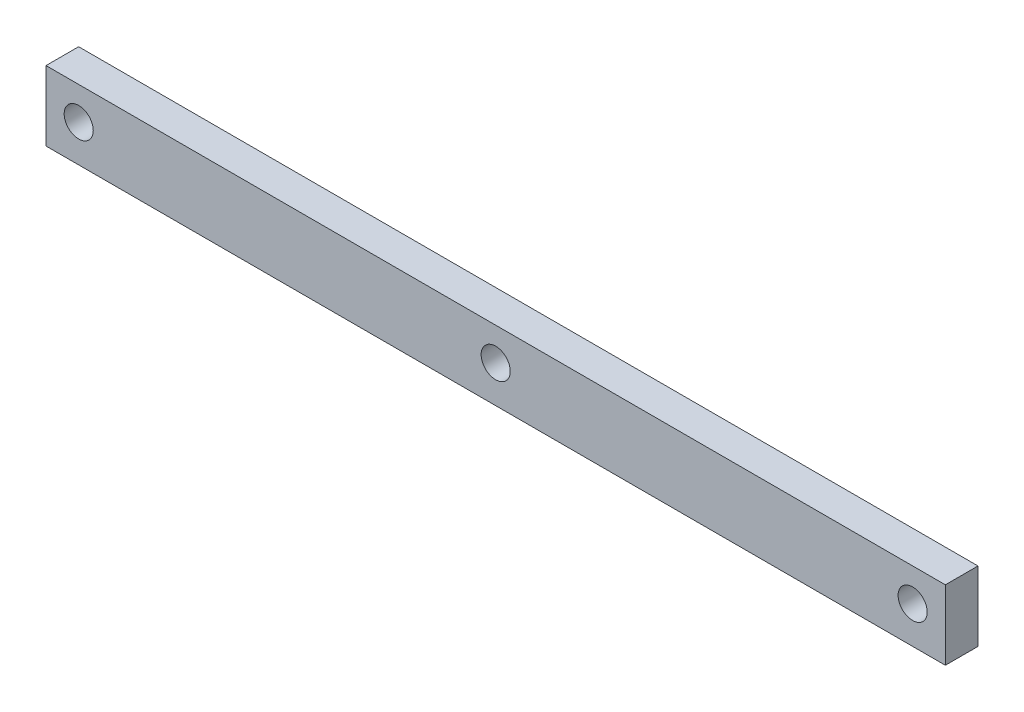
ISO-10303-21;
HEADER;
FILE_DESCRIPTION(('STEP AP214'),'2;1');
FILE_NAME('part.step','',(''),(''),'','','');
FILE_SCHEMA(('AUTOMOTIVE_DESIGN { 1 0 10303 214 1 1 1 1 }'));
ENDSEC;
DATA;
#1=APPLICATION_CONTEXT('core data for automotive mechanical design processes');
#2=APPLICATION_PROTOCOL_DEFINITION('international standard','automotive_design',2000,#1);
#3=PRODUCT_CONTEXT('',#1,'mechanical');
#4=PRODUCT('Part','Part','',(#3));
#5=PRODUCT_RELATED_PRODUCT_CATEGORY('part','',(#4));
#6=PRODUCT_DEFINITION_FORMATION('','',#4);
#7=PRODUCT_DEFINITION_CONTEXT('part definition',#1,'design');
#8=PRODUCT_DEFINITION('design','',#6,#7);
#9=PRODUCT_DEFINITION_SHAPE('','',#8);
#10=(LENGTH_UNIT() NAMED_UNIT(*) SI_UNIT(.MILLI.,.METRE.));
#11=(NAMED_UNIT(*) PLANE_ANGLE_UNIT() SI_UNIT($,.RADIAN.));
#12=(NAMED_UNIT(*) SI_UNIT($,.STERADIAN.) SOLID_ANGLE_UNIT());
#13=UNCERTAINTY_MEASURE_WITH_UNIT(LENGTH_MEASURE(1.E-05),#10,'distance_accuracy_value','');
#14=(GEOMETRIC_REPRESENTATION_CONTEXT(3) GLOBAL_UNCERTAINTY_ASSIGNED_CONTEXT((#13)) GLOBAL_UNIT_ASSIGNED_CONTEXT((#10,
#11,#12)) REPRESENTATION_CONTEXT('',''));
#15=CARTESIAN_POINT('',(0.,0.,0.));
#16=DIRECTION('',(0.,0.,1.));
#17=DIRECTION('',(1.,0.,0.));
#18=AXIS2_PLACEMENT_3D('',#15,#16,#17);
#19=CARTESIAN_POINT('',(43.735,4.85,3.175));
#20=DIRECTION('',(-1.,0.,0.));
#21=DIRECTION('',(0.,0.,1.));
#22=AXIS2_PLACEMENT_3D('',#19,#20,#21);
#23=PLANE('',#22);
#24=DIRECTION('',(0.,1.,0.));
#25=VECTOR('',#24,1.);
#26=CARTESIAN_POINT('',(43.735,4.85,3.175));
#27=LINE('',#26,#25);
#28=CARTESIAN_POINT('',(43.735,-1.93,3.175));
#29=VERTEX_POINT('',#28);
#30=CARTESIAN_POINT('',(43.735,4.85,3.175));
#31=VERTEX_POINT('',#30);
#32=EDGE_CURVE('E90',#29,#31,#27,.T.);
#33=ORIENTED_EDGE('',*,*,#32,.F.);
#34=DIRECTION('',(0.,0.,1.));
#35=VECTOR('',#34,1.);
#36=CARTESIAN_POINT('',(43.735,-1.93,-6.825));
#37=LINE('',#36,#35);
#38=CARTESIAN_POINT('',(43.735,-1.93,0.));
#39=VERTEX_POINT('',#38);
#40=EDGE_CURVE('E115',#39,#29,#37,.T.);
#41=ORIENTED_EDGE('',*,*,#40,.F.);
#42=DIRECTION('',(0.,1.,0.));
#43=VECTOR('',#42,1.);
#44=CARTESIAN_POINT('',(43.735,4.85,0.));
#45=LINE('',#44,#43);
#46=CARTESIAN_POINT('',(43.735,4.85,0.));
#47=VERTEX_POINT('',#46);
#48=EDGE_CURVE('E82',#39,#47,#45,.T.);
#49=ORIENTED_EDGE('',*,*,#48,.T.);
#50=DIRECTION('',(0.,0.,-1.));
#51=VECTOR('',#50,1.);
#52=CARTESIAN_POINT('',(43.735,4.85,3.175));
#53=LINE('',#52,#51);
#54=EDGE_CURVE('E44',#31,#47,#53,.T.);
#55=ORIENTED_EDGE('',*,*,#54,.F.);
#56=EDGE_LOOP('',(#33,#41,#49,#55));
#57=FACE_BOUND('',#56,.T.);
#58=ADVANCED_FACE('F37',(#57),#23,.F.);
#59=CARTESIAN_POINT('',(-43.735,4.85,3.175));
#60=DIRECTION('',(0.,-1.,0.));
#61=DIRECTION('',(0.,0.,-1.));
#62=AXIS2_PLACEMENT_3D('',#59,#60,#61);
#63=PLANE('',#62);
#64=DIRECTION('',(-1.,0.,0.));
#65=VECTOR('',#64,1.);
#66=CARTESIAN_POINT('',(-43.735,4.85,0.));
#67=LINE('',#66,#65);
#68=CARTESIAN_POINT('',(-43.735,4.85,0.));
#69=VERTEX_POINT('',#68);
#70=EDGE_CURVE('E72',#47,#69,#67,.T.);
#71=ORIENTED_EDGE('',*,*,#70,.T.);
#72=DIRECTION('',(0.,0.,-1.));
#73=VECTOR('',#72,1.);
#74=CARTESIAN_POINT('',(-43.735,4.85,3.175));
#75=LINE('',#74,#73);
#76=CARTESIAN_POINT('',(-43.735,4.85,3.175));
#77=VERTEX_POINT('',#76);
#78=EDGE_CURVE('E75',#77,#69,#75,.T.);
#79=ORIENTED_EDGE('',*,*,#78,.F.);
#80=DIRECTION('',(-1.,0.,0.));
#81=VECTOR('',#80,1.);
#82=CARTESIAN_POINT('',(-43.735,4.85,3.175));
#83=LINE('',#82,#81);
#84=EDGE_CURVE('E59',#31,#77,#83,.T.);
#85=ORIENTED_EDGE('',*,*,#84,.F.);
#86=ORIENTED_EDGE('',*,*,#54,.T.);
#87=EDGE_LOOP('',(#71,#79,#85,#86));
#88=FACE_BOUND('',#87,.T.);
#89=ADVANCED_FACE('F74',(#88),#63,.F.);
#90=CARTESIAN_POINT('',(-43.735,4.85,3.175));
#91=DIRECTION('',(1.,0.,0.));
#92=DIRECTION('',(0.,0.,-1.));
#93=AXIS2_PLACEMENT_3D('',#90,#91,#92);
#94=PLANE('',#93);
#95=DIRECTION('',(0.,-1.,0.));
#96=VECTOR('',#95,1.);
#97=CARTESIAN_POINT('',(-43.735,4.85,0.));
#98=LINE('',#97,#96);
#99=CARTESIAN_POINT('',(-43.735,-1.93,0.));
#100=VERTEX_POINT('',#99);
#101=EDGE_CURVE('E81',#69,#100,#98,.T.);
#102=ORIENTED_EDGE('',*,*,#101,.T.);
#103=DIRECTION('',(0.,0.,1.));
#104=VECTOR('',#103,1.);
#105=CARTESIAN_POINT('',(-43.735,-1.93,-6.825));
#106=LINE('',#105,#104);
#107=CARTESIAN_POINT('',(-43.735,-1.93,3.175));
#108=VERTEX_POINT('',#107);
#109=EDGE_CURVE('E51',#100,#108,#106,.T.);
#110=ORIENTED_EDGE('',*,*,#109,.T.);
#111=DIRECTION('',(0.,-1.,0.));
#112=VECTOR('',#111,1.);
#113=CARTESIAN_POINT('',(-43.735,4.85,3.175));
#114=LINE('',#113,#112);
#115=EDGE_CURVE('E87',#77,#108,#114,.T.);
#116=ORIENTED_EDGE('',*,*,#115,.F.);
#117=ORIENTED_EDGE('',*,*,#78,.T.);
#118=EDGE_LOOP('',(#102,#110,#116,#117));
#119=FACE_BOUND('',#118,.T.);
#120=ADVANCED_FACE('F86',(#119),#94,.F.);
#121=CARTESIAN_POINT('',(0.,0.,3.175));
#122=DIRECTION('',(0.,0.,1.));
#123=DIRECTION('',(1.,0.,0.));
#124=AXIS2_PLACEMENT_3D('',#121,#122,#123);
#125=PLANE('',#124);
#126=DIRECTION('',(-1.,0.,0.));
#127=VECTOR('',#126,1.);
#128=CARTESIAN_POINT('',(0.,-1.93,3.175));
#129=LINE('',#128,#127);
#130=EDGE_CURVE('E121',#29,#108,#129,.T.);
#131=ORIENTED_EDGE('',*,*,#130,.F.);
#132=ORIENTED_EDGE('',*,*,#32,.T.);
#133=ORIENTED_EDGE('',*,*,#84,.T.);
#134=ORIENTED_EDGE('',*,*,#115,.T.);
#135=EDGE_LOOP('',(#131,#132,#133,#134));
#136=FACE_BOUND('',#135,.T.);
#137=CARTESIAN_POINT('',(-40.5530194846605,1.66801948466055,3.175));
#138=DIRECTION('',(0.,0.,1.));
#139=DIRECTION('',(1.,0.,0.));
#140=AXIS2_PLACEMENT_3D('',#137,#138,#139);
#141=CIRCLE('',#140,1.415);
#142=CARTESIAN_POINT('',(-39.1380194846605,1.66801948466055,3.175));
#143=VERTEX_POINT('',#142);
#144=EDGE_CURVE('E100',#143,#143,#141,.T.);
#145=ORIENTED_EDGE('',*,*,#144,.F.);
#146=EDGE_LOOP('',(#145));
#147=FACE_BOUND('',#146,.T.);
#148=CARTESIAN_POINT('',(0.,1.66801948466055,3.175));
#149=DIRECTION('',(0.,0.,1.));
#150=DIRECTION('',(1.,0.,0.));
#151=AXIS2_PLACEMENT_3D('',#148,#149,#150);
#152=CIRCLE('',#151,1.415);
#153=CARTESIAN_POINT('',(1.415,1.66801948466055,3.175));
#154=VERTEX_POINT('',#153);
#155=EDGE_CURVE('E114',#154,#154,#152,.T.);
#156=ORIENTED_EDGE('',*,*,#155,.F.);
#157=EDGE_LOOP('',(#156));
#158=FACE_BOUND('',#157,.T.);
#159=CARTESIAN_POINT('',(40.5530194846605,1.66801948466056,3.175));
#160=DIRECTION('',(0.,0.,1.));
#161=DIRECTION('',(-1.,0.,0.));
#162=AXIS2_PLACEMENT_3D('',#159,#160,#161);
#163=CIRCLE('',#162,1.415);
#164=CARTESIAN_POINT('',(39.1380194846605,1.66801948466056,3.175));
#165=VERTEX_POINT('',#164);
#166=EDGE_CURVE('E111',#165,#165,#163,.T.);
#167=ORIENTED_EDGE('',*,*,#166,.F.);
#168=EDGE_LOOP('',(#167));
#169=FACE_BOUND('',#168,.T.);
#170=ADVANCED_FACE('F130',(#136,#147,#158,#169),#125,.T.);
#171=CARTESIAN_POINT('',(0.,0.,0.));
#172=DIRECTION('',(0.,0.,1.));
#173=DIRECTION('',(1.,0.,0.));
#174=AXIS2_PLACEMENT_3D('',#171,#172,#173);
#175=PLANE('',#174);
#176=CARTESIAN_POINT('',(-40.5530194846605,1.66801948466055,0.));
#177=DIRECTION('',(0.,0.,1.));
#178=DIRECTION('',(1.,0.,0.));
#179=AXIS2_PLACEMENT_3D('',#176,#177,#178);
#180=CIRCLE('',#179,1.415);
#181=CARTESIAN_POINT('',(-39.1380194846605,1.66801948466055,0.));
#182=VERTEX_POINT('',#181);
#183=EDGE_CURVE('E102',#182,#182,#180,.T.);
#184=ORIENTED_EDGE('',*,*,#183,.T.);
#185=EDGE_LOOP('',(#184));
#186=FACE_BOUND('',#185,.T.);
#187=CARTESIAN_POINT('',(0.,1.66801948466055,0.));
#188=DIRECTION('',(0.,0.,1.));
#189=DIRECTION('',(1.,0.,0.));
#190=AXIS2_PLACEMENT_3D('',#187,#188,#189);
#191=CIRCLE('',#190,1.415);
#192=CARTESIAN_POINT('',(1.415,1.66801948466055,0.));
#193=VERTEX_POINT('',#192);
#194=EDGE_CURVE('E99',#193,#193,#191,.T.);
#195=ORIENTED_EDGE('',*,*,#194,.T.);
#196=EDGE_LOOP('',(#195));
#197=FACE_BOUND('',#196,.T.);
#198=CARTESIAN_POINT('',(40.5530194846605,1.66801948466056,0.));
#199=DIRECTION('',(0.,0.,1.));
#200=DIRECTION('',(1.,0.,0.));
#201=AXIS2_PLACEMENT_3D('',#198,#199,#200);
#202=CIRCLE('',#201,1.415);
#203=CARTESIAN_POINT('',(41.9680194846605,1.66801948466056,0.));
#204=VERTEX_POINT('',#203);
#205=EDGE_CURVE('E96',#204,#204,#202,.T.);
#206=ORIENTED_EDGE('',*,*,#205,.T.);
#207=EDGE_LOOP('',(#206));
#208=FACE_BOUND('',#207,.T.);
#209=ORIENTED_EDGE('',*,*,#48,.F.);
#210=DIRECTION('',(-1.,0.,0.));
#211=VECTOR('',#210,1.);
#212=CARTESIAN_POINT('',(0.,-1.93,0.));
#213=LINE('',#212,#211);
#214=EDGE_CURVE('E11',#39,#100,#213,.T.);
#215=ORIENTED_EDGE('',*,*,#214,.T.);
#216=ORIENTED_EDGE('',*,*,#101,.F.);
#217=ORIENTED_EDGE('',*,*,#70,.F.);
#218=EDGE_LOOP('',(#209,#215,#216,#217));
#219=FACE_BOUND('',#218,.T.);
#220=ADVANCED_FACE('F89',(#186,#197,#208,#219),#175,.F.);
#221=CARTESIAN_POINT('',(40.5530194846605,1.66801948466056,-6.825));
#222=DIRECTION('',(0.,0.,1.));
#223=DIRECTION('',(1.,0.,0.));
#224=AXIS2_PLACEMENT_3D('',#221,#222,#223);
#225=CYLINDRICAL_SURFACE('',#224,1.415);
#226=ORIENTED_EDGE('',*,*,#166,.T.);
#227=EDGE_LOOP('',(#226));
#228=FACE_BOUND('',#227,.T.);
#229=ORIENTED_EDGE('',*,*,#205,.F.);
#230=EDGE_LOOP('',(#229));
#231=FACE_BOUND('',#230,.T.);
#232=ADVANCED_FACE('F140',(#228,#231),#225,.F.);
#233=CARTESIAN_POINT('',(0.,1.66801948466055,-6.825));
#234=DIRECTION('',(0.,0.,1.));
#235=DIRECTION('',(1.,0.,0.));
#236=AXIS2_PLACEMENT_3D('',#233,#234,#235);
#237=CYLINDRICAL_SURFACE('',#236,1.415);
#238=ORIENTED_EDGE('',*,*,#155,.T.);
#239=EDGE_LOOP('',(#238));
#240=FACE_BOUND('',#239,.T.);
#241=ORIENTED_EDGE('',*,*,#194,.F.);
#242=EDGE_LOOP('',(#241));
#243=FACE_BOUND('',#242,.T.);
#244=ADVANCED_FACE('F143',(#240,#243),#237,.F.);
#245=CARTESIAN_POINT('',(-40.5530194846605,1.66801948466055,-6.825));
#246=DIRECTION('',(0.,0.,1.));
#247=DIRECTION('',(1.,0.,0.));
#248=AXIS2_PLACEMENT_3D('',#245,#246,#247);
#249=CYLINDRICAL_SURFACE('',#248,1.415);
#250=ORIENTED_EDGE('',*,*,#144,.T.);
#251=EDGE_LOOP('',(#250));
#252=FACE_BOUND('',#251,.T.);
#253=ORIENTED_EDGE('',*,*,#183,.F.);
#254=EDGE_LOOP('',(#253));
#255=FACE_BOUND('',#254,.T.);
#256=ADVANCED_FACE('F180',(#252,#255),#249,.F.);
#257=CARTESIAN_POINT('',(0.,-1.93,-6.825));
#258=DIRECTION('',(0.,1.,0.));
#259=DIRECTION('',(-1.,0.,0.));
#260=AXIS2_PLACEMENT_3D('',#257,#258,#259);
#261=PLANE('',#260);
#262=ORIENTED_EDGE('',*,*,#40,.T.);
#263=ORIENTED_EDGE('',*,*,#130,.T.);
#264=ORIENTED_EDGE('',*,*,#109,.F.);
#265=ORIENTED_EDGE('',*,*,#214,.F.);
#266=EDGE_LOOP('',(#262,#263,#264,#265));
#267=FACE_BOUND('',#266,.T.);
#268=ADVANCED_FACE('F126',(#267),#261,.F.);
#269=CLOSED_SHELL('',(#58,#89,#120,#170,#220,#232,#244,#256,#268));
#270=MANIFOLD_SOLID_BREP('B2',#269);
#271=ADVANCED_BREP_SHAPE_REPRESENTATION('',(#18,#270),#14);
#272=SHAPE_DEFINITION_REPRESENTATION(#9,#271);
ENDSEC;
END-ISO-10303-21;
